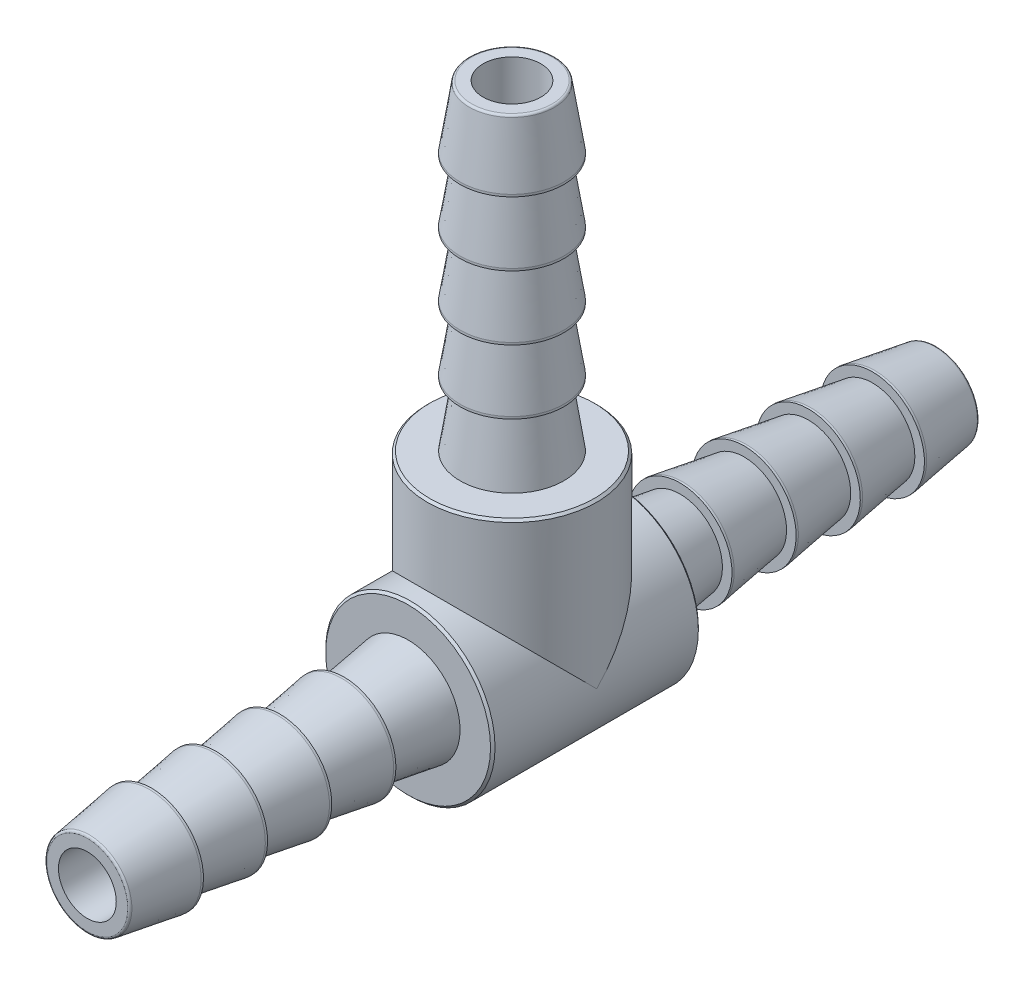
ISO-10303-21;
HEADER;
FILE_DESCRIPTION(('STEP AP214'),'2;1');
FILE_NAME('part.step','',(''),(''),'','','');
FILE_SCHEMA(('AUTOMOTIVE_DESIGN { 1 0 10303 214 1 1 1 1 }'));
ENDSEC;
DATA;
#1=APPLICATION_CONTEXT('core data for automotive mechanical design processes');
#2=APPLICATION_PROTOCOL_DEFINITION('international standard','automotive_design',2000,#1);
#3=PRODUCT_CONTEXT('',#1,'mechanical');
#4=PRODUCT('Part','Part','',(#3));
#5=PRODUCT_RELATED_PRODUCT_CATEGORY('part','',(#4));
#6=PRODUCT_DEFINITION_FORMATION('','',#4);
#7=PRODUCT_DEFINITION_CONTEXT('part definition',#1,'design');
#8=PRODUCT_DEFINITION('design','',#6,#7);
#9=PRODUCT_DEFINITION_SHAPE('','',#8);
#10=(LENGTH_UNIT() NAMED_UNIT(*) SI_UNIT(.MILLI.,.METRE.));
#11=(NAMED_UNIT(*) PLANE_ANGLE_UNIT() SI_UNIT($,.RADIAN.));
#12=(NAMED_UNIT(*) SI_UNIT($,.STERADIAN.) SOLID_ANGLE_UNIT());
#13=UNCERTAINTY_MEASURE_WITH_UNIT(LENGTH_MEASURE(1.E-05),#10,'distance_accuracy_value','');
#14=(GEOMETRIC_REPRESENTATION_CONTEXT(3) GLOBAL_UNCERTAINTY_ASSIGNED_CONTEXT((#13)) GLOBAL_UNIT_ASSIGNED_CONTEXT((#10,
#11,#12)) REPRESENTATION_CONTEXT('',''));
#15=CARTESIAN_POINT('',(0.,0.,0.));
#16=DIRECTION('',(0.,0.,1.));
#17=DIRECTION('',(1.,0.,0.));
#18=AXIS2_PLACEMENT_3D('',#15,#16,#17);
#19=CARTESIAN_POINT('',(0.,0.,23.876));
#20=DIRECTION('',(0.,0.,-1.));
#21=DIRECTION('',(-1.,0.,0.));
#22=AXIS2_PLACEMENT_3D('',#19,#20,#21);
#23=PLANE('',#22);
#24=CARTESIAN_POINT('',(0.,0.,23.876));
#25=DIRECTION('',(0.,0.,-1.));
#26=DIRECTION('',(-1.,0.,0.));
#27=AXIS2_PLACEMENT_3D('',#24,#25,#26);
#28=CIRCLE('',#27,2.27243024163016);
#29=CARTESIAN_POINT('',(-2.27243024163016,0.,23.876));
#30=VERTEX_POINT('',#29);
#31=EDGE_CURVE('E11',#30,#30,#28,.F.);
#32=ORIENTED_EDGE('',*,*,#31,.T.);
#33=EDGE_LOOP('',(#32));
#34=FACE_BOUND('',#33,.T.);
#35=CARTESIAN_POINT('',(0.,0.,23.876));
#36=DIRECTION('',(0.,0.,1.));
#37=DIRECTION('',(1.,0.,0.));
#38=AXIS2_PLACEMENT_3D('',#35,#36,#37);
#39=CIRCLE('',#38,1.6256);
#40=CARTESIAN_POINT('',(1.6256,0.,23.876));
#41=VERTEX_POINT('',#40);
#42=EDGE_CURVE('E91',#41,#41,#39,.T.);
#43=ORIENTED_EDGE('',*,*,#42,.F.);
#44=EDGE_LOOP('',(#43));
#45=FACE_BOUND('',#44,.T.);
#46=ADVANCED_FACE('F43',(#34,#45),#23,.F.);
#47=CARTESIAN_POINT('',(0.,0.,0.));
#48=DIRECTION('',(0.,-1.,0.));
#49=DIRECTION('',(0.,0.,-1.));
#50=AXIS2_PLACEMENT_3D('',#47,#48,#49);
#51=CYLINDRICAL_SURFACE('',#50,4.7625);
#52=CARTESIAN_POINT('',(0.,9.08049999999999,0.));
#53=DIRECTION('',(0.,1.,0.));
#54=DIRECTION('',(0.,0.,1.));
#55=AXIS2_PLACEMENT_3D('',#52,#53,#54);
#56=CIRCLE('',#55,4.7625);
#57=CARTESIAN_POINT('',(0.,9.08049999999999,4.7625));
#58=VERTEX_POINT('',#57);
#59=EDGE_CURVE('E84',#58,#58,#56,.F.);
#60=ORIENTED_EDGE('',*,*,#59,.T.);
#61=EDGE_LOOP('',(#60));
#62=FACE_BOUND('',#61,.T.);
#63=CARTESIAN_POINT('',(0.,0.,0.));
#64=DIRECTION('',(0.,0.707106781186547,0.707106781186547));
#65=DIRECTION('',(0.,-0.707106781186547,0.707106781186547));
#66=AXIS2_PLACEMENT_3D('',#63,#64,#65);
#67=ELLIPSE('',#66,6.73519209080187,4.7625);
#68=CARTESIAN_POINT('',(4.7625,0.,0.));
#69=VERTEX_POINT('',#68);
#70=CARTESIAN_POINT('',(-4.7625,0.,0.));
#71=VERTEX_POINT('',#70);
#72=EDGE_CURVE('E70',#69,#71,#67,.T.);
#73=ORIENTED_EDGE('',*,*,#72,.T.);
#74=CARTESIAN_POINT('',(0.,0.,0.));
#75=DIRECTION('',(0.,-0.707106781186547,0.707106781186547));
#76=DIRECTION('',(0.,0.707106781186547,0.707106781186547));
#77=AXIS2_PLACEMENT_3D('',#74,#75,#76);
#78=ELLIPSE('',#77,6.73519209080187,4.7625);
#79=EDGE_CURVE('E85',#71,#69,#78,.F.);
#80=ORIENTED_EDGE('',*,*,#79,.T.);
#81=EDGE_LOOP('',(#73,#80));
#82=FACE_BOUND('',#81,.T.);
#83=ADVANCED_FACE('F319',(#62,#82),#51,.T.);
#84=CARTESIAN_POINT('',(0.,0.,23.876));
#85=DIRECTION('',(0.,0.,1.));
#86=DIRECTION('',(1.,0.,0.));
#87=AXIS2_PLACEMENT_3D('',#84,#85,#86);
#88=CYLINDRICAL_SURFACE('',#87,4.7625);
#89=CARTESIAN_POINT('',(0.,0.,-5.715));
#90=DIRECTION('',(0.,0.,-1.));
#91=DIRECTION('',(-1.,0.,0.));
#92=AXIS2_PLACEMENT_3D('',#89,#90,#91);
#93=CIRCLE('',#92,4.7625);
#94=CARTESIAN_POINT('',(-4.7625,0.,-5.715));
#95=VERTEX_POINT('',#94);
#96=EDGE_CURVE('E274',#95,#95,#93,.F.);
#97=ORIENTED_EDGE('',*,*,#96,.T.);
#98=EDGE_LOOP('',(#97));
#99=FACE_BOUND('',#98,.T.);
#100=CARTESIAN_POINT('',(0.,0.,5.715));
#101=DIRECTION('',(0.,0.,1.));
#102=DIRECTION('',(1.,0.,0.));
#103=AXIS2_PLACEMENT_3D('',#100,#101,#102);
#104=CIRCLE('',#103,4.7625);
#105=CARTESIAN_POINT('',(4.7625,0.,5.715));
#106=VERTEX_POINT('',#105);
#107=EDGE_CURVE('E270',#106,#106,#104,.F.);
#108=ORIENTED_EDGE('',*,*,#107,.T.);
#109=EDGE_LOOP('',(#108));
#110=FACE_BOUND('',#109,.T.);
#111=ORIENTED_EDGE('',*,*,#79,.F.);
#112=ORIENTED_EDGE('',*,*,#72,.F.);
#113=EDGE_LOOP('',(#111,#112));
#114=FACE_BOUND('',#113,.T.);
#115=ADVANCED_FACE('F325',(#99,#110,#114),#88,.T.);
#116=CARTESIAN_POINT('',(0.,0.,16.7894));
#117=DIRECTION('',(0.,0.,-1.));
#118=DIRECTION('',(0.,1.,0.));
#119=AXIS2_PLACEMENT_3D('',#116,#117,#118);
#120=CONICAL_SURFACE('',#119,2.921,0.153883218638279);
#121=CARTESIAN_POINT('',(0.,0.,20.2692));
#122=DIRECTION('',(0.,0.,-1.));
#123=DIRECTION('',(0.,1.,0.));
#124=AXIS2_PLACEMENT_3D('',#121,#122,#123);
#125=CIRCLE('',#124,2.38125);
#126=CARTESIAN_POINT('',(0.,2.38125,20.2692));
#127=VERTEX_POINT('',#126);
#128=EDGE_CURVE('E231',#127,#127,#125,.T.);
#129=ORIENTED_EDGE('',*,*,#128,.T.);
#130=EDGE_LOOP('',(#129));
#131=FACE_BOUND('',#130,.T.);
#132=CARTESIAN_POINT('',(0.,0.,16.7894));
#133=DIRECTION('',(0.,0.,-1.));
#134=DIRECTION('',(0.,1.,0.));
#135=AXIS2_PLACEMENT_3D('',#132,#133,#134);
#136=CIRCLE('',#135,2.921);
#137=CARTESIAN_POINT('',(0.,2.921,16.7894));
#138=VERTEX_POINT('',#137);
#139=EDGE_CURVE('E239',#138,#138,#136,.T.);
#140=ORIENTED_EDGE('',*,*,#139,.F.);
#141=EDGE_LOOP('',(#140));
#142=FACE_BOUND('',#141,.T.);
#143=ADVANCED_FACE('F479',(#131,#142),#120,.T.);
#144=CARTESIAN_POINT('',(0.,0.,2.2352));
#145=DIRECTION('',(0.,0.,-1.));
#146=DIRECTION('',(0.,1.,0.));
#147=AXIS2_PLACEMENT_3D('',#144,#145,#146);
#148=CYLINDRICAL_SURFACE('',#147,2.921);
#149=ORIENTED_EDGE('',*,*,#139,.T.);
#150=EDGE_LOOP('',(#149));
#151=FACE_BOUND('',#150,.T.);
#152=CARTESIAN_POINT('',(0.,0.,16.6624));
#153=DIRECTION('',(0.,0.,-1.));
#154=DIRECTION('',(0.,1.,0.));
#155=AXIS2_PLACEMENT_3D('',#152,#153,#154);
#156=CIRCLE('',#155,2.921);
#157=CARTESIAN_POINT('',(0.,2.921,16.6624));
#158=VERTEX_POINT('',#157);
#159=EDGE_CURVE('E235',#158,#158,#156,.T.);
#160=ORIENTED_EDGE('',*,*,#159,.F.);
#161=EDGE_LOOP('',(#160));
#162=FACE_BOUND('',#161,.T.);
#163=ADVANCED_FACE('F475',(#151,#162),#148,.T.);
#164=CARTESIAN_POINT('',(0.,2.38125,16.6624));
#165=DIRECTION('',(0.,0.,-1.));
#166=DIRECTION('',(0.,1.,0.));
#167=AXIS2_PLACEMENT_3D('',#164,#165,#166);
#168=PLANE('',#167);
#169=ORIENTED_EDGE('',*,*,#159,.T.);
#170=EDGE_LOOP('',(#169));
#171=FACE_BOUND('',#170,.T.);
#172=CARTESIAN_POINT('',(0.,0.,16.6624));
#173=DIRECTION('',(0.,0.,-1.));
#174=DIRECTION('',(0.,1.,0.));
#175=AXIS2_PLACEMENT_3D('',#172,#173,#174);
#176=CIRCLE('',#175,2.38125);
#177=CARTESIAN_POINT('',(0.,2.38125,16.6624));
#178=VERTEX_POINT('',#177);
#179=EDGE_CURVE('E219',#178,#178,#176,.T.);
#180=ORIENTED_EDGE('',*,*,#179,.F.);
#181=EDGE_LOOP('',(#180));
#182=FACE_BOUND('',#181,.T.);
#183=ADVANCED_FACE('F472',(#171,#182),#168,.T.);
#184=CARTESIAN_POINT('',(0.,0.,20.3962));
#185=DIRECTION('',(0.,0.,-1.));
#186=DIRECTION('',(0.,1.,0.));
#187=AXIS2_PLACEMENT_3D('',#184,#185,#186);
#188=CONICAL_SURFACE('',#187,2.921,0.153883218638279);
#189=CARTESIAN_POINT('',(0.,0.,23.7684661295191));
#190=DIRECTION('',(0.,0.,-1.));
#191=DIRECTION('',(0.,1.,0.));
#192=AXIS2_PLACEMENT_3D('',#189,#190,#191);
#193=CIRCLE('',#192,2.39792952370598);
#194=CARTESIAN_POINT('',(0.,2.39792952370598,23.7684661295191));
#195=VERTEX_POINT('',#194);
#196=EDGE_CURVE('E52',#195,#195,#193,.T.);
#197=ORIENTED_EDGE('',*,*,#196,.T.);
#198=EDGE_LOOP('',(#197));
#199=FACE_BOUND('',#198,.T.);
#200=CARTESIAN_POINT('',(0.,0.,20.3962));
#201=DIRECTION('',(0.,0.,-1.));
#202=DIRECTION('',(0.,1.,0.));
#203=AXIS2_PLACEMENT_3D('',#200,#201,#202);
#204=CIRCLE('',#203,2.921);
#205=CARTESIAN_POINT('',(0.,2.921,20.3962));
#206=VERTEX_POINT('',#205);
#207=EDGE_CURVE('E247',#206,#206,#204,.T.);
#208=ORIENTED_EDGE('',*,*,#207,.F.);
#209=EDGE_LOOP('',(#208));
#210=FACE_BOUND('',#209,.T.);
#211=ADVANCED_FACE('F306',(#199,#210),#188,.T.);
#212=CARTESIAN_POINT('',(0.,0.,5.842));
#213=DIRECTION('',(0.,0.,-1.));
#214=DIRECTION('',(0.,1.,0.));
#215=AXIS2_PLACEMENT_3D('',#212,#213,#214);
#216=CYLINDRICAL_SURFACE('',#215,2.921);
#217=ORIENTED_EDGE('',*,*,#207,.T.);
#218=EDGE_LOOP('',(#217));
#219=FACE_BOUND('',#218,.T.);
#220=CARTESIAN_POINT('',(0.,0.,20.2692));
#221=DIRECTION('',(0.,0.,-1.));
#222=DIRECTION('',(0.,1.,0.));
#223=AXIS2_PLACEMENT_3D('',#220,#221,#222);
#224=CIRCLE('',#223,2.921);
#225=CARTESIAN_POINT('',(0.,2.921,20.2692));
#226=VERTEX_POINT('',#225);
#227=EDGE_CURVE('E243',#226,#226,#224,.T.);
#228=ORIENTED_EDGE('',*,*,#227,.F.);
#229=EDGE_LOOP('',(#228));
#230=FACE_BOUND('',#229,.T.);
#231=ADVANCED_FACE('F486',(#219,#230),#216,.T.);
#232=CARTESIAN_POINT('',(0.,2.38125,20.2692));
#233=DIRECTION('',(0.,0.,-1.));
#234=DIRECTION('',(0.,1.,0.));
#235=AXIS2_PLACEMENT_3D('',#232,#233,#234);
#236=PLANE('',#235);
#237=ORIENTED_EDGE('',*,*,#227,.T.);
#238=EDGE_LOOP('',(#237));
#239=FACE_BOUND('',#238,.T.);
#240=ORIENTED_EDGE('',*,*,#128,.F.);
#241=EDGE_LOOP('',(#240));
#242=FACE_BOUND('',#241,.T.);
#243=ADVANCED_FACE('F470',(#239,#242),#236,.T.);
#244=CARTESIAN_POINT('',(0.,0.,13.1826));
#245=DIRECTION('',(0.,0.,-1.));
#246=DIRECTION('',(0.,1.,0.));
#247=AXIS2_PLACEMENT_3D('',#244,#245,#246);
#248=CONICAL_SURFACE('',#247,2.921,0.153883218638279);
#249=ORIENTED_EDGE('',*,*,#179,.T.);
#250=EDGE_LOOP('',(#249));
#251=FACE_BOUND('',#250,.T.);
#252=CARTESIAN_POINT('',(0.,0.,13.1826));
#253=DIRECTION('',(0.,0.,-1.));
#254=DIRECTION('',(0.,1.,0.));
#255=AXIS2_PLACEMENT_3D('',#252,#253,#254);
#256=CIRCLE('',#255,2.921);
#257=CARTESIAN_POINT('',(0.,2.921,13.1826));
#258=VERTEX_POINT('',#257);
#259=EDGE_CURVE('E227',#258,#258,#256,.T.);
#260=ORIENTED_EDGE('',*,*,#259,.F.);
#261=EDGE_LOOP('',(#260));
#262=FACE_BOUND('',#261,.T.);
#263=ADVANCED_FACE('F466',(#251,#262),#248,.T.);
#264=CARTESIAN_POINT('',(0.,0.,-1.3716));
#265=DIRECTION('',(0.,0.,-1.));
#266=DIRECTION('',(0.,1.,0.));
#267=AXIS2_PLACEMENT_3D('',#264,#265,#266);
#268=CYLINDRICAL_SURFACE('',#267,2.921);
#269=ORIENTED_EDGE('',*,*,#259,.T.);
#270=EDGE_LOOP('',(#269));
#271=FACE_BOUND('',#270,.T.);
#272=CARTESIAN_POINT('',(0.,0.,13.0556));
#273=DIRECTION('',(0.,0.,-1.));
#274=DIRECTION('',(0.,1.,0.));
#275=AXIS2_PLACEMENT_3D('',#272,#273,#274);
#276=CIRCLE('',#275,2.921);
#277=CARTESIAN_POINT('',(0.,2.921,13.0556));
#278=VERTEX_POINT('',#277);
#279=EDGE_CURVE('E223',#278,#278,#276,.T.);
#280=ORIENTED_EDGE('',*,*,#279,.F.);
#281=EDGE_LOOP('',(#280));
#282=FACE_BOUND('',#281,.T.);
#283=ADVANCED_FACE('F462',(#271,#282),#268,.T.);
#284=CARTESIAN_POINT('',(0.,2.38125,13.0556));
#285=DIRECTION('',(0.,0.,-1.));
#286=DIRECTION('',(0.,1.,0.));
#287=AXIS2_PLACEMENT_3D('',#284,#285,#286);
#288=PLANE('',#287);
#289=ORIENTED_EDGE('',*,*,#279,.T.);
#290=EDGE_LOOP('',(#289));
#291=FACE_BOUND('',#290,.T.);
#292=CARTESIAN_POINT('',(0.,0.,13.0556));
#293=DIRECTION('',(0.,0.,-1.));
#294=DIRECTION('',(0.,1.,0.));
#295=AXIS2_PLACEMENT_3D('',#292,#293,#294);
#296=CIRCLE('',#295,2.38125);
#297=CARTESIAN_POINT('',(0.,2.38125,13.0556));
#298=VERTEX_POINT('',#297);
#299=EDGE_CURVE('E207',#298,#298,#296,.T.);
#300=ORIENTED_EDGE('',*,*,#299,.F.);
#301=EDGE_LOOP('',(#300));
#302=FACE_BOUND('',#301,.T.);
#303=ADVANCED_FACE('F458',(#291,#302),#288,.T.);
#304=CARTESIAN_POINT('',(0.,0.,9.5758));
#305=DIRECTION('',(0.,0.,-1.));
#306=DIRECTION('',(0.,1.,0.));
#307=AXIS2_PLACEMENT_3D('',#304,#305,#306);
#308=CONICAL_SURFACE('',#307,2.921,0.153883218638279);
#309=ORIENTED_EDGE('',*,*,#299,.T.);
#310=EDGE_LOOP('',(#309));
#311=FACE_BOUND('',#310,.T.);
#312=CARTESIAN_POINT('',(0.,0.,9.5758));
#313=DIRECTION('',(0.,0.,-1.));
#314=DIRECTION('',(0.,1.,0.));
#315=AXIS2_PLACEMENT_3D('',#312,#313,#314);
#316=CIRCLE('',#315,2.921);
#317=CARTESIAN_POINT('',(0.,2.921,9.5758));
#318=VERTEX_POINT('',#317);
#319=EDGE_CURVE('E215',#318,#318,#316,.T.);
#320=ORIENTED_EDGE('',*,*,#319,.F.);
#321=EDGE_LOOP('',(#320));
#322=FACE_BOUND('',#321,.T.);
#323=ADVANCED_FACE('F454',(#311,#322),#308,.T.);
#324=CARTESIAN_POINT('',(0.,0.,-4.9784));
#325=DIRECTION('',(0.,0.,-1.));
#326=DIRECTION('',(0.,1.,0.));
#327=AXIS2_PLACEMENT_3D('',#324,#325,#326);
#328=CYLINDRICAL_SURFACE('',#327,2.921);
#329=ORIENTED_EDGE('',*,*,#319,.T.);
#330=EDGE_LOOP('',(#329));
#331=FACE_BOUND('',#330,.T.);
#332=CARTESIAN_POINT('',(0.,0.,9.4488));
#333=DIRECTION('',(0.,0.,-1.));
#334=DIRECTION('',(0.,1.,0.));
#335=AXIS2_PLACEMENT_3D('',#332,#333,#334);
#336=CIRCLE('',#335,2.921);
#337=CARTESIAN_POINT('',(0.,2.921,9.4488));
#338=VERTEX_POINT('',#337);
#339=EDGE_CURVE('E211',#338,#338,#336,.T.);
#340=ORIENTED_EDGE('',*,*,#339,.F.);
#341=EDGE_LOOP('',(#340));
#342=FACE_BOUND('',#341,.T.);
#343=ADVANCED_FACE('F450',(#331,#342),#328,.T.);
#344=CARTESIAN_POINT('',(0.,2.38125,9.4488));
#345=DIRECTION('',(0.,0.,-1.));
#346=DIRECTION('',(0.,1.,0.));
#347=AXIS2_PLACEMENT_3D('',#344,#345,#346);
#348=PLANE('',#347);
#349=ORIENTED_EDGE('',*,*,#339,.T.);
#350=EDGE_LOOP('',(#349));
#351=FACE_BOUND('',#350,.T.);
#352=CARTESIAN_POINT('',(0.,0.,9.4488));
#353=DIRECTION('',(0.,0.,1.));
#354=DIRECTION('',(1.,0.,0.));
#355=AXIS2_PLACEMENT_3D('',#352,#353,#354);
#356=CIRCLE('',#355,2.38125);
#357=CARTESIAN_POINT('',(2.38125,0.,9.4488));
#358=VERTEX_POINT('',#357);
#359=EDGE_CURVE('E255',#358,#358,#356,.T.);
#360=ORIENTED_EDGE('',*,*,#359,.T.);
#361=EDGE_LOOP('',(#360));
#362=FACE_BOUND('',#361,.T.);
#363=ADVANCED_FACE('F446',(#351,#362),#348,.T.);
#364=CARTESIAN_POINT('',(0.,2.921,5.842));
#365=DIRECTION('',(0.,0.,1.));
#366=DIRECTION('',(1.,0.,0.));
#367=AXIS2_PLACEMENT_3D('',#364,#365,#366);
#368=PLANE('',#367);
#369=CARTESIAN_POINT('',(0.,0.,5.842));
#370=DIRECTION('',(0.,0.,1.));
#371=DIRECTION('',(1.,0.,0.));
#372=AXIS2_PLACEMENT_3D('',#369,#370,#371);
#373=CIRCLE('',#372,4.6355);
#374=CARTESIAN_POINT('',(4.6355,0.,5.842));
#375=VERTEX_POINT('',#374);
#376=EDGE_CURVE('E282',#375,#375,#373,.T.);
#377=ORIENTED_EDGE('',*,*,#376,.T.);
#378=EDGE_LOOP('',(#377));
#379=FACE_BOUND('',#378,.T.);
#380=CARTESIAN_POINT('',(0.,0.,5.842));
#381=DIRECTION('',(0.,0.,1.));
#382=DIRECTION('',(1.,0.,0.));
#383=AXIS2_PLACEMENT_3D('',#380,#381,#382);
#384=CIRCLE('',#383,2.921);
#385=CARTESIAN_POINT('',(2.921,0.,5.842));
#386=VERTEX_POINT('',#385);
#387=EDGE_CURVE('E251',#386,#386,#384,.T.);
#388=ORIENTED_EDGE('',*,*,#387,.F.);
#389=EDGE_LOOP('',(#388));
#390=FACE_BOUND('',#389,.T.);
#391=ADVANCED_FACE('F449',(#379,#390),#368,.T.);
#392=CARTESIAN_POINT('',(0.,0.,9.4488));
#393=DIRECTION('',(0.,0.,-1.));
#394=DIRECTION('',(-1.,0.,0.));
#395=AXIS2_PLACEMENT_3D('',#392,#393,#394);
#396=CONICAL_SURFACE('',#395,2.38125,0.148545565358798);
#397=ORIENTED_EDGE('',*,*,#387,.T.);
#398=EDGE_LOOP('',(#397));
#399=FACE_BOUND('',#398,.T.);
#400=ORIENTED_EDGE('',*,*,#359,.F.);
#401=EDGE_LOOP('',(#400));
#402=FACE_BOUND('',#401,.T.);
#403=ADVANCED_FACE('F444',(#399,#402),#396,.T.);
#404=CARTESIAN_POINT('',(0.,0.,-9.4488));
#405=DIRECTION('',(0.,0.,1.));
#406=DIRECTION('',(-1.,0.,0.));
#407=AXIS2_PLACEMENT_3D('',#404,#405,#406);
#408=CONICAL_SURFACE('',#407,2.38125,0.148545565358798);
#409=CARTESIAN_POINT('',(0.,0.,-5.842));
#410=DIRECTION('',(0.,0.,1.));
#411=DIRECTION('',(1.,0.,0.));
#412=AXIS2_PLACEMENT_3D('',#409,#410,#411);
#413=CIRCLE('',#412,2.921);
#414=CARTESIAN_POINT('',(2.921,0.,-5.842));
#415=VERTEX_POINT('',#414);
#416=EDGE_CURVE('E203',#415,#415,#413,.T.);
#417=ORIENTED_EDGE('',*,*,#416,.F.);
#418=EDGE_LOOP('',(#417));
#419=FACE_BOUND('',#418,.T.);
#420=CARTESIAN_POINT('',(0.,0.,-9.4488));
#421=DIRECTION('',(0.,0.,-1.));
#422=DIRECTION('',(0.,1.,0.));
#423=AXIS2_PLACEMENT_3D('',#420,#421,#422);
#424=CIRCLE('',#423,2.38125);
#425=CARTESIAN_POINT('',(0.,2.38125,-9.4488));
#426=VERTEX_POINT('',#425);
#427=EDGE_CURVE('E159',#426,#426,#424,.T.);
#428=ORIENTED_EDGE('',*,*,#427,.F.);
#429=EDGE_LOOP('',(#428));
#430=FACE_BOUND('',#429,.T.);
#431=ADVANCED_FACE('F440',(#419,#430),#408,.T.);
#432=CARTESIAN_POINT('',(0.,2.921,-5.842));
#433=DIRECTION('',(0.,0.,-1.));
#434=DIRECTION('',(1.,0.,0.));
#435=AXIS2_PLACEMENT_3D('',#432,#433,#434);
#436=PLANE('',#435);
#437=CARTESIAN_POINT('',(0.,0.,-5.842));
#438=DIRECTION('',(0.,0.,-1.));
#439=DIRECTION('',(-1.,0.,0.));
#440=AXIS2_PLACEMENT_3D('',#437,#438,#439);
#441=CIRCLE('',#440,4.63550000000001);
#442=CARTESIAN_POINT('',(-4.63550000000001,0.,-5.842));
#443=VERTEX_POINT('',#442);
#444=EDGE_CURVE('E278',#443,#443,#441,.T.);
#445=ORIENTED_EDGE('',*,*,#444,.T.);
#446=EDGE_LOOP('',(#445));
#447=FACE_BOUND('',#446,.T.);
#448=ORIENTED_EDGE('',*,*,#416,.T.);
#449=EDGE_LOOP('',(#448));
#450=FACE_BOUND('',#449,.T.);
#451=ADVANCED_FACE('F402',(#447,#450),#436,.T.);
#452=CARTESIAN_POINT('',(0.,0.,-9.5758));
#453=DIRECTION('',(0.,0.,1.));
#454=DIRECTION('',(0.,1.,0.));
#455=AXIS2_PLACEMENT_3D('',#452,#453,#454);
#456=CONICAL_SURFACE('',#455,2.921,0.153883218638279);
#457=CARTESIAN_POINT('',(0.,0.,-13.0556));
#458=DIRECTION('',(0.,0.,-1.));
#459=DIRECTION('',(0.,1.,0.));
#460=AXIS2_PLACEMENT_3D('',#457,#458,#459);
#461=CIRCLE('',#460,2.38125);
#462=CARTESIAN_POINT('',(0.,2.38125,-13.0556));
#463=VERTEX_POINT('',#462);
#464=EDGE_CURVE('E155',#463,#463,#461,.T.);
#465=ORIENTED_EDGE('',*,*,#464,.F.);
#466=EDGE_LOOP('',(#465));
#467=FACE_BOUND('',#466,.T.);
#468=CARTESIAN_POINT('',(0.,0.,-9.5758));
#469=DIRECTION('',(0.,0.,-1.));
#470=DIRECTION('',(0.,1.,0.));
#471=AXIS2_PLACEMENT_3D('',#468,#469,#470);
#472=CIRCLE('',#471,2.921);
#473=CARTESIAN_POINT('',(0.,2.921,-9.5758));
#474=VERTEX_POINT('',#473);
#475=EDGE_CURVE('E167',#474,#474,#472,.T.);
#476=ORIENTED_EDGE('',*,*,#475,.T.);
#477=EDGE_LOOP('',(#476));
#478=FACE_BOUND('',#477,.T.);
#479=ADVANCED_FACE('F398',(#467,#478),#456,.T.);
#480=CARTESIAN_POINT('',(0.,0.,4.9784));
#481=DIRECTION('',(0.,0.,1.));
#482=DIRECTION('',(0.,1.,0.));
#483=AXIS2_PLACEMENT_3D('',#480,#481,#482);
#484=CYLINDRICAL_SURFACE('',#483,2.921);
#485=ORIENTED_EDGE('',*,*,#475,.F.);
#486=EDGE_LOOP('',(#485));
#487=FACE_BOUND('',#486,.T.);
#488=CARTESIAN_POINT('',(0.,0.,-9.4488));
#489=DIRECTION('',(0.,0.,-1.));
#490=DIRECTION('',(0.,1.,0.));
#491=AXIS2_PLACEMENT_3D('',#488,#489,#490);
#492=CIRCLE('',#491,2.921);
#493=CARTESIAN_POINT('',(0.,2.921,-9.4488));
#494=VERTEX_POINT('',#493);
#495=EDGE_CURVE('E163',#494,#494,#492,.T.);
#496=ORIENTED_EDGE('',*,*,#495,.T.);
#497=EDGE_LOOP('',(#496));
#498=FACE_BOUND('',#497,.T.);
#499=ADVANCED_FACE('F394',(#487,#498),#484,.T.);
#500=CARTESIAN_POINT('',(0.,2.38125,-9.4488));
#501=DIRECTION('',(0.,0.,1.));
#502=DIRECTION('',(0.,1.,0.));
#503=AXIS2_PLACEMENT_3D('',#500,#501,#502);
#504=PLANE('',#503);
#505=ORIENTED_EDGE('',*,*,#495,.F.);
#506=EDGE_LOOP('',(#505));
#507=FACE_BOUND('',#506,.T.);
#508=ORIENTED_EDGE('',*,*,#427,.T.);
#509=EDGE_LOOP('',(#508));
#510=FACE_BOUND('',#509,.T.);
#511=ADVANCED_FACE('F336',(#507,#510),#504,.T.);
#512=CARTESIAN_POINT('',(0.,0.,-23.876));
#513=DIRECTION('',(0.,0.,1.));
#514=DIRECTION('',(1.,0.,0.));
#515=AXIS2_PLACEMENT_3D('',#512,#513,#514);
#516=PLANE('',#515);
#517=CARTESIAN_POINT('',(0.,0.,-23.876));
#518=DIRECTION('',(0.,0.,1.));
#519=DIRECTION('',(1.,0.,0.));
#520=AXIS2_PLACEMENT_3D('',#517,#518,#519);
#521=CIRCLE('',#520,2.27243024163016);
#522=CARTESIAN_POINT('',(2.27243024163016,0.,-23.876));
#523=VERTEX_POINT('',#522);
#524=EDGE_CURVE('E298',#523,#523,#521,.F.);
#525=ORIENTED_EDGE('',*,*,#524,.T.);
#526=EDGE_LOOP('',(#525));
#527=FACE_BOUND('',#526,.T.);
#528=ADVANCED_FACE('F332',(#527),#516,.F.);
#529=CARTESIAN_POINT('',(0.,0.,-20.3962));
#530=DIRECTION('',(0.,0.,1.));
#531=DIRECTION('',(0.,1.,0.));
#532=AXIS2_PLACEMENT_3D('',#529,#530,#531);
#533=CONICAL_SURFACE('',#532,2.921,0.153883218638279);
#534=CARTESIAN_POINT('',(0.,0.,-23.7684661295191));
#535=DIRECTION('',(0.,0.,1.));
#536=DIRECTION('',(0.,-1.,0.));
#537=AXIS2_PLACEMENT_3D('',#534,#535,#536);
#538=CIRCLE('',#537,2.39792952370598);
#539=CARTESIAN_POINT('',(0.,-2.39792952370598,-23.7684661295191));
#540=VERTEX_POINT('',#539);
#541=EDGE_CURVE('E294',#540,#540,#538,.T.);
#542=ORIENTED_EDGE('',*,*,#541,.T.);
#543=EDGE_LOOP('',(#542));
#544=FACE_BOUND('',#543,.T.);
#545=CARTESIAN_POINT('',(0.,0.,-20.3962));
#546=DIRECTION('',(0.,0.,-1.));
#547=DIRECTION('',(0.,1.,0.));
#548=AXIS2_PLACEMENT_3D('',#545,#546,#547);
#549=CIRCLE('',#548,2.921);
#550=CARTESIAN_POINT('',(0.,2.921,-20.3962));
#551=VERTEX_POINT('',#550);
#552=EDGE_CURVE('E199',#551,#551,#549,.T.);
#553=ORIENTED_EDGE('',*,*,#552,.T.);
#554=EDGE_LOOP('',(#553));
#555=FACE_BOUND('',#554,.T.);
#556=ADVANCED_FACE('F335',(#544,#555),#533,.T.);
#557=CARTESIAN_POINT('',(0.,0.,-5.842));
#558=DIRECTION('',(0.,0.,1.));
#559=DIRECTION('',(0.,1.,0.));
#560=AXIS2_PLACEMENT_3D('',#557,#558,#559);
#561=CYLINDRICAL_SURFACE('',#560,2.921);
#562=ORIENTED_EDGE('',*,*,#552,.F.);
#563=EDGE_LOOP('',(#562));
#564=FACE_BOUND('',#563,.T.);
#565=CARTESIAN_POINT('',(0.,0.,-20.2692));
#566=DIRECTION('',(0.,0.,-1.));
#567=DIRECTION('',(0.,1.,0.));
#568=AXIS2_PLACEMENT_3D('',#565,#566,#567);
#569=CIRCLE('',#568,2.921);
#570=CARTESIAN_POINT('',(0.,2.921,-20.2692));
#571=VERTEX_POINT('',#570);
#572=EDGE_CURVE('E195',#571,#571,#569,.T.);
#573=ORIENTED_EDGE('',*,*,#572,.T.);
#574=EDGE_LOOP('',(#573));
#575=FACE_BOUND('',#574,.T.);
#576=ADVANCED_FACE('F430',(#564,#575),#561,.T.);
#577=CARTESIAN_POINT('',(0.,2.38125,-20.2692));
#578=DIRECTION('',(0.,0.,1.));
#579=DIRECTION('',(0.,1.,0.));
#580=AXIS2_PLACEMENT_3D('',#577,#578,#579);
#581=PLANE('',#580);
#582=ORIENTED_EDGE('',*,*,#572,.F.);
#583=EDGE_LOOP('',(#582));
#584=FACE_BOUND('',#583,.T.);
#585=CARTESIAN_POINT('',(0.,0.,-20.2692));
#586=DIRECTION('',(0.,0.,-1.));
#587=DIRECTION('',(0.,1.,0.));
#588=AXIS2_PLACEMENT_3D('',#585,#586,#587);
#589=CIRCLE('',#588,2.38125);
#590=CARTESIAN_POINT('',(0.,2.38125,-20.2692));
#591=VERTEX_POINT('',#590);
#592=EDGE_CURVE('E183',#591,#591,#589,.T.);
#593=ORIENTED_EDGE('',*,*,#592,.T.);
#594=EDGE_LOOP('',(#593));
#595=FACE_BOUND('',#594,.T.);
#596=ADVANCED_FACE('F426',(#584,#595),#581,.T.);
#597=CARTESIAN_POINT('',(0.,0.,-16.7894));
#598=DIRECTION('',(0.,0.,1.));
#599=DIRECTION('',(0.,1.,0.));
#600=AXIS2_PLACEMENT_3D('',#597,#598,#599);
#601=CONICAL_SURFACE('',#600,2.921,0.153883218638279);
#602=ORIENTED_EDGE('',*,*,#592,.F.);
#603=EDGE_LOOP('',(#602));
#604=FACE_BOUND('',#603,.T.);
#605=CARTESIAN_POINT('',(0.,0.,-16.7894));
#606=DIRECTION('',(0.,0.,-1.));
#607=DIRECTION('',(0.,1.,0.));
#608=AXIS2_PLACEMENT_3D('',#605,#606,#607);
#609=CIRCLE('',#608,2.921);
#610=CARTESIAN_POINT('',(0.,2.921,-16.7894));
#611=VERTEX_POINT('',#610);
#612=EDGE_CURVE('E191',#611,#611,#609,.T.);
#613=ORIENTED_EDGE('',*,*,#612,.T.);
#614=EDGE_LOOP('',(#613));
#615=FACE_BOUND('',#614,.T.);
#616=ADVANCED_FACE('F422',(#604,#615),#601,.T.);
#617=CARTESIAN_POINT('',(0.,0.,-2.2352));
#618=DIRECTION('',(0.,0.,1.));
#619=DIRECTION('',(0.,1.,0.));
#620=AXIS2_PLACEMENT_3D('',#617,#618,#619);
#621=CYLINDRICAL_SURFACE('',#620,2.921);
#622=ORIENTED_EDGE('',*,*,#612,.F.);
#623=EDGE_LOOP('',(#622));
#624=FACE_BOUND('',#623,.T.);
#625=CARTESIAN_POINT('',(0.,0.,-16.6624));
#626=DIRECTION('',(0.,0.,-1.));
#627=DIRECTION('',(0.,1.,0.));
#628=AXIS2_PLACEMENT_3D('',#625,#626,#627);
#629=CIRCLE('',#628,2.921);
#630=CARTESIAN_POINT('',(0.,2.921,-16.6624));
#631=VERTEX_POINT('',#630);
#632=EDGE_CURVE('E187',#631,#631,#629,.T.);
#633=ORIENTED_EDGE('',*,*,#632,.T.);
#634=EDGE_LOOP('',(#633));
#635=FACE_BOUND('',#634,.T.);
#636=ADVANCED_FACE('F418',(#624,#635),#621,.T.);
#637=CARTESIAN_POINT('',(0.,2.38125,-16.6624));
#638=DIRECTION('',(0.,0.,1.));
#639=DIRECTION('',(0.,1.,0.));
#640=AXIS2_PLACEMENT_3D('',#637,#638,#639);
#641=PLANE('',#640);
#642=ORIENTED_EDGE('',*,*,#632,.F.);
#643=EDGE_LOOP('',(#642));
#644=FACE_BOUND('',#643,.T.);
#645=CARTESIAN_POINT('',(0.,0.,-16.6624));
#646=DIRECTION('',(0.,0.,-1.));
#647=DIRECTION('',(0.,1.,0.));
#648=AXIS2_PLACEMENT_3D('',#645,#646,#647);
#649=CIRCLE('',#648,2.38125);
#650=CARTESIAN_POINT('',(0.,2.38125,-16.6624));
#651=VERTEX_POINT('',#650);
#652=EDGE_CURVE('E171',#651,#651,#649,.T.);
#653=ORIENTED_EDGE('',*,*,#652,.T.);
#654=EDGE_LOOP('',(#653));
#655=FACE_BOUND('',#654,.T.);
#656=ADVANCED_FACE('F414',(#644,#655),#641,.T.);
#657=CARTESIAN_POINT('',(0.,0.,-13.1826));
#658=DIRECTION('',(0.,0.,1.));
#659=DIRECTION('',(0.,1.,0.));
#660=AXIS2_PLACEMENT_3D('',#657,#658,#659);
#661=CONICAL_SURFACE('',#660,2.921,0.153883218638279);
#662=ORIENTED_EDGE('',*,*,#652,.F.);
#663=EDGE_LOOP('',(#662));
#664=FACE_BOUND('',#663,.T.);
#665=CARTESIAN_POINT('',(0.,0.,-13.1826));
#666=DIRECTION('',(0.,0.,-1.));
#667=DIRECTION('',(0.,1.,0.));
#668=AXIS2_PLACEMENT_3D('',#665,#666,#667);
#669=CIRCLE('',#668,2.921);
#670=CARTESIAN_POINT('',(0.,2.921,-13.1826));
#671=VERTEX_POINT('',#670);
#672=EDGE_CURVE('E179',#671,#671,#669,.T.);
#673=ORIENTED_EDGE('',*,*,#672,.T.);
#674=EDGE_LOOP('',(#673));
#675=FACE_BOUND('',#674,.T.);
#676=ADVANCED_FACE('F410',(#664,#675),#661,.T.);
#677=CARTESIAN_POINT('',(0.,0.,1.3716));
#678=DIRECTION('',(0.,0.,1.));
#679=DIRECTION('',(0.,1.,0.));
#680=AXIS2_PLACEMENT_3D('',#677,#678,#679);
#681=CYLINDRICAL_SURFACE('',#680,2.921);
#682=ORIENTED_EDGE('',*,*,#672,.F.);
#683=EDGE_LOOP('',(#682));
#684=FACE_BOUND('',#683,.T.);
#685=CARTESIAN_POINT('',(0.,0.,-13.0556));
#686=DIRECTION('',(0.,0.,-1.));
#687=DIRECTION('',(0.,1.,0.));
#688=AXIS2_PLACEMENT_3D('',#685,#686,#687);
#689=CIRCLE('',#688,2.921);
#690=CARTESIAN_POINT('',(0.,2.921,-13.0556));
#691=VERTEX_POINT('',#690);
#692=EDGE_CURVE('E175',#691,#691,#689,.T.);
#693=ORIENTED_EDGE('',*,*,#692,.T.);
#694=EDGE_LOOP('',(#693));
#695=FACE_BOUND('',#694,.T.);
#696=ADVANCED_FACE('F406',(#684,#695),#681,.T.);
#697=CARTESIAN_POINT('',(0.,2.38125,-13.0556));
#698=DIRECTION('',(0.,0.,1.));
#699=DIRECTION('',(0.,1.,0.));
#700=AXIS2_PLACEMENT_3D('',#697,#698,#699);
#701=PLANE('',#700);
#702=ORIENTED_EDGE('',*,*,#692,.F.);
#703=EDGE_LOOP('',(#702));
#704=FACE_BOUND('',#703,.T.);
#705=ORIENTED_EDGE('',*,*,#464,.T.);
#706=EDGE_LOOP('',(#705));
#707=FACE_BOUND('',#706,.T.);
#708=ADVANCED_FACE('F385',(#704,#707),#701,.T.);
#709=CARTESIAN_POINT('',(0.,9.2075,0.));
#710=DIRECTION('',(0.,-1.,0.));
#711=DIRECTION('',(0.,0.,-1.));
#712=AXIS2_PLACEMENT_3D('',#709,#710,#711);
#713=CONICAL_SURFACE('',#712,2.921,0.148545565358799);
#714=CARTESIAN_POINT('',(0.,12.8143,0.));
#715=DIRECTION('',(0.,1.,0.));
#716=DIRECTION('',(0.,0.,1.));
#717=AXIS2_PLACEMENT_3D('',#714,#715,#716);
#718=CIRCLE('',#717,2.38125);
#719=CARTESIAN_POINT('',(0.,12.8143,2.38125));
#720=VERTEX_POINT('',#719);
#721=EDGE_CURVE('E115',#720,#720,#718,.T.);
#722=ORIENTED_EDGE('',*,*,#721,.F.);
#723=EDGE_LOOP('',(#722));
#724=FACE_BOUND('',#723,.T.);
#725=CARTESIAN_POINT('',(0.,9.2075,0.));
#726=DIRECTION('',(0.,-1.,0.));
#727=DIRECTION('',(0.,0.,-1.));
#728=AXIS2_PLACEMENT_3D('',#725,#726,#727);
#729=CIRCLE('',#728,2.921);
#730=CARTESIAN_POINT('',(0.,9.2075,-2.921));
#731=VERTEX_POINT('',#730);
#732=EDGE_CURVE('E151',#731,#731,#729,.T.);
#733=ORIENTED_EDGE('',*,*,#732,.F.);
#734=EDGE_LOOP('',(#733));
#735=FACE_BOUND('',#734,.T.);
#736=ADVANCED_FACE('F382',(#724,#735),#713,.T.);
#737=CARTESIAN_POINT('',(0.,9.2075,2.921));
#738=DIRECTION('',(0.,1.,0.));
#739=DIRECTION('',(0.,0.,1.));
#740=AXIS2_PLACEMENT_3D('',#737,#738,#739);
#741=PLANE('',#740);
#742=CARTESIAN_POINT('',(0.,9.2075,0.));
#743=DIRECTION('',(0.,1.,0.));
#744=DIRECTION('',(0.,0.,1.));
#745=AXIS2_PLACEMENT_3D('',#742,#743,#744);
#746=CIRCLE('',#745,4.63549999999999);
#747=CARTESIAN_POINT('',(0.,9.2075,4.63549999999999));
#748=VERTEX_POINT('',#747);
#749=EDGE_CURVE('E266',#748,#748,#746,.T.);
#750=ORIENTED_EDGE('',*,*,#749,.T.);
#751=EDGE_LOOP('',(#750));
#752=FACE_BOUND('',#751,.T.);
#753=ORIENTED_EDGE('',*,*,#732,.T.);
#754=EDGE_LOOP('',(#753));
#755=FACE_BOUND('',#754,.T.);
#756=ADVANCED_FACE('F378',(#752,#755),#741,.T.);
#757=CARTESIAN_POINT('',(0.,12.8143,2.921));
#758=DIRECTION('',(0.,-1.,0.));
#759=DIRECTION('',(0.,0.,-1.));
#760=AXIS2_PLACEMENT_3D('',#757,#758,#759);
#761=PLANE('',#760);
#762=ORIENTED_EDGE('',*,*,#721,.T.);
#763=EDGE_LOOP('',(#762));
#764=FACE_BOUND('',#763,.T.);
#765=CARTESIAN_POINT('',(0.,12.8143,0.));
#766=DIRECTION('',(0.,1.,0.));
#767=DIRECTION('',(0.,0.,1.));
#768=AXIS2_PLACEMENT_3D('',#765,#766,#767);
#769=CIRCLE('',#768,2.921);
#770=CARTESIAN_POINT('',(0.,12.8143,2.921));
#771=VERTEX_POINT('',#770);
#772=EDGE_CURVE('E111',#771,#771,#769,.T.);
#773=ORIENTED_EDGE('',*,*,#772,.F.);
#774=EDGE_LOOP('',(#773));
#775=FACE_BOUND('',#774,.T.);
#776=ADVANCED_FACE('F381',(#764,#775),#761,.T.);
#777=CARTESIAN_POINT('',(0.,16.4211,0.));
#778=DIRECTION('',(0.,1.,0.));
#779=DIRECTION('',(0.,0.,1.));
#780=AXIS2_PLACEMENT_3D('',#777,#778,#779);
#781=CYLINDRICAL_SURFACE('',#780,2.921);
#782=ORIENTED_EDGE('',*,*,#772,.T.);
#783=EDGE_LOOP('',(#782));
#784=FACE_BOUND('',#783,.T.);
#785=CARTESIAN_POINT('',(0.,12.9413,0.));
#786=DIRECTION('',(0.,1.,0.));
#787=DIRECTION('',(0.,0.,1.));
#788=AXIS2_PLACEMENT_3D('',#785,#786,#787);
#789=CIRCLE('',#788,2.921);
#790=CARTESIAN_POINT('',(0.,12.9413,2.921));
#791=VERTEX_POINT('',#790);
#792=EDGE_CURVE('E103',#791,#791,#789,.T.);
#793=ORIENTED_EDGE('',*,*,#792,.F.);
#794=EDGE_LOOP('',(#793));
#795=FACE_BOUND('',#794,.T.);
#796=ADVANCED_FACE('F586',(#784,#795),#781,.T.);
#797=CARTESIAN_POINT('',(0.,16.4211,0.));
#798=DIRECTION('',(0.,-1.,0.));
#799=DIRECTION('',(0.,0.,-1.));
#800=AXIS2_PLACEMENT_3D('',#797,#798,#799);
#801=CONICAL_SURFACE('',#800,2.38125,0.153883218638279);
#802=ORIENTED_EDGE('',*,*,#792,.T.);
#803=EDGE_LOOP('',(#802));
#804=FACE_BOUND('',#803,.T.);
#805=CARTESIAN_POINT('',(0.,16.4211,0.));
#806=DIRECTION('',(0.,1.,0.));
#807=DIRECTION('',(0.,0.,1.));
#808=AXIS2_PLACEMENT_3D('',#805,#806,#807);
#809=CIRCLE('',#808,2.38125);
#810=CARTESIAN_POINT('',(0.,16.4211,2.38125));
#811=VERTEX_POINT('',#810);
#812=EDGE_CURVE('E97',#811,#811,#809,.T.);
#813=ORIENTED_EDGE('',*,*,#812,.F.);
#814=EDGE_LOOP('',(#813));
#815=FACE_BOUND('',#814,.T.);
#816=ADVANCED_FACE('F390',(#804,#815),#801,.T.);
#817=CARTESIAN_POINT('',(0.,27.2415,0.));
#818=DIRECTION('',(0.,-1.,0.));
#819=DIRECTION('',(0.,0.,-1.));
#820=AXIS2_PLACEMENT_3D('',#817,#818,#819);
#821=PLANE('',#820);
#822=CARTESIAN_POINT('',(0.,27.2415,0.));
#823=DIRECTION('',(0.,-1.,0.));
#824=DIRECTION('',(0.,0.,-1.));
#825=AXIS2_PLACEMENT_3D('',#822,#823,#824);
#826=CIRCLE('',#825,2.27243024163016);
#827=CARTESIAN_POINT('',(0.,27.2415,-2.27243024163016));
#828=VERTEX_POINT('',#827);
#829=EDGE_CURVE('E290',#828,#828,#826,.F.);
#830=ORIENTED_EDGE('',*,*,#829,.T.);
#831=EDGE_LOOP('',(#830));
#832=FACE_BOUND('',#831,.T.);
#833=CARTESIAN_POINT('',(0.,27.2415,0.));
#834=DIRECTION('',(0.,1.,0.));
#835=DIRECTION('',(0.,0.,1.));
#836=AXIS2_PLACEMENT_3D('',#833,#834,#835);
#837=CIRCLE('',#836,1.6256);
#838=CARTESIAN_POINT('',(0.,27.2415,1.6256));
#839=VERTEX_POINT('',#838);
#840=EDGE_CURVE('E92',#839,#839,#837,.T.);
#841=ORIENTED_EDGE('',*,*,#840,.F.);
#842=EDGE_LOOP('',(#841));
#843=FACE_BOUND('',#842,.T.);
#844=ADVANCED_FACE('F362',(#832,#843),#821,.F.);
#845=CARTESIAN_POINT('',(0.,27.2415,0.));
#846=DIRECTION('',(0.,-1.,0.));
#847=DIRECTION('',(0.,0.,-1.));
#848=AXIS2_PLACEMENT_3D('',#845,#846,#847);
#849=CONICAL_SURFACE('',#848,2.38125,0.153883218638279);
#850=CARTESIAN_POINT('',(0.,27.1339661295191,0.));
#851=DIRECTION('',(0.,-1.,0.));
#852=DIRECTION('',(0.,0.,-1.));
#853=AXIS2_PLACEMENT_3D('',#850,#851,#852);
#854=CIRCLE('',#853,2.39792952370598);
#855=CARTESIAN_POINT('',(0.,27.1339661295191,-2.39792952370598));
#856=VERTEX_POINT('',#855);
#857=EDGE_CURVE('E286',#856,#856,#854,.T.);
#858=ORIENTED_EDGE('',*,*,#857,.T.);
#859=EDGE_LOOP('',(#858));
#860=FACE_BOUND('',#859,.T.);
#861=CARTESIAN_POINT('',(0.,23.7617,0.));
#862=DIRECTION('',(0.,1.,0.));
#863=DIRECTION('',(0.,0.,1.));
#864=AXIS2_PLACEMENT_3D('',#861,#862,#863);
#865=CIRCLE('',#864,2.921);
#866=CARTESIAN_POINT('',(0.,23.7617,2.921));
#867=VERTEX_POINT('',#866);
#868=EDGE_CURVE('E143',#867,#867,#865,.T.);
#869=ORIENTED_EDGE('',*,*,#868,.T.);
#870=EDGE_LOOP('',(#869));
#871=FACE_BOUND('',#870,.T.);
#872=ADVANCED_FACE('F358',(#860,#871),#849,.T.);
#873=CARTESIAN_POINT('',(0.,27.2415,0.));
#874=DIRECTION('',(0.,1.,0.));
#875=DIRECTION('',(0.,0.,1.));
#876=AXIS2_PLACEMENT_3D('',#873,#874,#875);
#877=CYLINDRICAL_SURFACE('',#876,2.921);
#878=CARTESIAN_POINT('',(0.,23.6347,0.));
#879=DIRECTION('',(0.,1.,0.));
#880=DIRECTION('',(0.,0.,1.));
#881=AXIS2_PLACEMENT_3D('',#878,#879,#880);
#882=CIRCLE('',#881,2.921);
#883=CARTESIAN_POINT('',(0.,23.6347,2.921));
#884=VERTEX_POINT('',#883);
#885=EDGE_CURVE('E147',#884,#884,#882,.T.);
#886=ORIENTED_EDGE('',*,*,#885,.T.);
#887=EDGE_LOOP('',(#886));
#888=FACE_BOUND('',#887,.T.);
#889=ORIENTED_EDGE('',*,*,#868,.F.);
#890=EDGE_LOOP('',(#889));
#891=FACE_BOUND('',#890,.T.);
#892=ADVANCED_FACE('F361',(#888,#891),#877,.T.);
#893=CARTESIAN_POINT('',(0.,23.6347,2.921));
#894=DIRECTION('',(0.,-1.,0.));
#895=DIRECTION('',(0.,0.,-1.));
#896=AXIS2_PLACEMENT_3D('',#893,#894,#895);
#897=PLANE('',#896);
#898=CARTESIAN_POINT('',(0.,23.6347,0.));
#899=DIRECTION('',(0.,1.,0.));
#900=DIRECTION('',(0.,0.,1.));
#901=AXIS2_PLACEMENT_3D('',#898,#899,#900);
#902=CIRCLE('',#901,2.38125);
#903=CARTESIAN_POINT('',(0.,23.6347,2.38125));
#904=VERTEX_POINT('',#903);
#905=EDGE_CURVE('E131',#904,#904,#902,.T.);
#906=ORIENTED_EDGE('',*,*,#905,.T.);
#907=EDGE_LOOP('',(#906));
#908=FACE_BOUND('',#907,.T.);
#909=ORIENTED_EDGE('',*,*,#885,.F.);
#910=EDGE_LOOP('',(#909));
#911=FACE_BOUND('',#910,.T.);
#912=ADVANCED_FACE('F367',(#908,#911),#897,.T.);
#913=CARTESIAN_POINT('',(0.,23.6347,0.));
#914=DIRECTION('',(0.,-1.,0.));
#915=DIRECTION('',(0.,0.,-1.));
#916=AXIS2_PLACEMENT_3D('',#913,#914,#915);
#917=CONICAL_SURFACE('',#916,2.38125,0.153883218638279);
#918=CARTESIAN_POINT('',(0.,20.1549,0.));
#919=DIRECTION('',(0.,1.,0.));
#920=DIRECTION('',(0.,0.,1.));
#921=AXIS2_PLACEMENT_3D('',#918,#919,#920);
#922=CIRCLE('',#921,2.921);
#923=CARTESIAN_POINT('',(0.,20.1549,2.921));
#924=VERTEX_POINT('',#923);
#925=EDGE_CURVE('E135',#924,#924,#922,.T.);
#926=ORIENTED_EDGE('',*,*,#925,.T.);
#927=EDGE_LOOP('',(#926));
#928=FACE_BOUND('',#927,.T.);
#929=ORIENTED_EDGE('',*,*,#905,.F.);
#930=EDGE_LOOP('',(#929));
#931=FACE_BOUND('',#930,.T.);
#932=ADVANCED_FACE('F373',(#928,#931),#917,.T.);
#933=CARTESIAN_POINT('',(0.,23.6347,0.));
#934=DIRECTION('',(0.,1.,0.));
#935=DIRECTION('',(0.,0.,1.));
#936=AXIS2_PLACEMENT_3D('',#933,#934,#935);
#937=CYLINDRICAL_SURFACE('',#936,2.921);
#938=CARTESIAN_POINT('',(0.,20.0279,0.));
#939=DIRECTION('',(0.,1.,0.));
#940=DIRECTION('',(0.,0.,1.));
#941=AXIS2_PLACEMENT_3D('',#938,#939,#940);
#942=CIRCLE('',#941,2.921);
#943=CARTESIAN_POINT('',(0.,20.0279,2.921));
#944=VERTEX_POINT('',#943);
#945=EDGE_CURVE('E139',#944,#944,#942,.T.);
#946=ORIENTED_EDGE('',*,*,#945,.T.);
#947=EDGE_LOOP('',(#946));
#948=FACE_BOUND('',#947,.T.);
#949=ORIENTED_EDGE('',*,*,#925,.F.);
#950=EDGE_LOOP('',(#949));
#951=FACE_BOUND('',#950,.T.);
#952=ADVANCED_FACE('F703',(#948,#951),#937,.T.);
#953=CARTESIAN_POINT('',(0.,20.0279,2.921));
#954=DIRECTION('',(0.,-1.,0.));
#955=DIRECTION('',(0.,0.,-1.));
#956=AXIS2_PLACEMENT_3D('',#953,#954,#955);
#957=PLANE('',#956);
#958=CARTESIAN_POINT('',(0.,20.0279,0.));
#959=DIRECTION('',(0.,1.,0.));
#960=DIRECTION('',(0.,0.,1.));
#961=AXIS2_PLACEMENT_3D('',#958,#959,#960);
#962=CIRCLE('',#961,2.38125);
#963=CARTESIAN_POINT('',(0.,20.0279,2.38125));
#964=VERTEX_POINT('',#963);
#965=EDGE_CURVE('E119',#964,#964,#962,.T.);
#966=ORIENTED_EDGE('',*,*,#965,.T.);
#967=EDGE_LOOP('',(#966));
#968=FACE_BOUND('',#967,.T.);
#969=ORIENTED_EDGE('',*,*,#945,.F.);
#970=EDGE_LOOP('',(#969));
#971=FACE_BOUND('',#970,.T.);
#972=ADVANCED_FACE('F694',(#968,#971),#957,.T.);
#973=CARTESIAN_POINT('',(0.,20.0279,0.));
#974=DIRECTION('',(0.,-1.,0.));
#975=DIRECTION('',(0.,0.,-1.));
#976=AXIS2_PLACEMENT_3D('',#973,#974,#975);
#977=CONICAL_SURFACE('',#976,2.38125,0.153883218638279);
#978=CARTESIAN_POINT('',(0.,16.5481,0.));
#979=DIRECTION('',(0.,1.,0.));
#980=DIRECTION('',(0.,0.,1.));
#981=AXIS2_PLACEMENT_3D('',#978,#979,#980);
#982=CIRCLE('',#981,2.921);
#983=CARTESIAN_POINT('',(0.,16.5481,2.921));
#984=VERTEX_POINT('',#983);
#985=EDGE_CURVE('E123',#984,#984,#982,.T.);
#986=ORIENTED_EDGE('',*,*,#985,.T.);
#987=EDGE_LOOP('',(#986));
#988=FACE_BOUND('',#987,.T.);
#989=ORIENTED_EDGE('',*,*,#965,.F.);
#990=EDGE_LOOP('',(#989));
#991=FACE_BOUND('',#990,.T.);
#992=ADVANCED_FACE('F685',(#988,#991),#977,.T.);
#993=CARTESIAN_POINT('',(0.,20.0279,0.));
#994=DIRECTION('',(0.,1.,0.));
#995=DIRECTION('',(0.,0.,1.));
#996=AXIS2_PLACEMENT_3D('',#993,#994,#995);
#997=CYLINDRICAL_SURFACE('',#996,2.921);
#998=CARTESIAN_POINT('',(0.,16.4211,0.));
#999=DIRECTION('',(0.,1.,0.));
#1000=DIRECTION('',(0.,0.,1.));
#1001=AXIS2_PLACEMENT_3D('',#998,#999,#1000);
#1002=CIRCLE('',#1001,2.921);
#1003=CARTESIAN_POINT('',(0.,16.4211,2.921));
#1004=VERTEX_POINT('',#1003);
#1005=EDGE_CURVE('E127',#1004,#1004,#1002,.T.);
#1006=ORIENTED_EDGE('',*,*,#1005,.T.);
#1007=EDGE_LOOP('',(#1006));
#1008=FACE_BOUND('',#1007,.T.);
#1009=ORIENTED_EDGE('',*,*,#985,.F.);
#1010=EDGE_LOOP('',(#1009));
#1011=FACE_BOUND('',#1010,.T.);
#1012=ADVANCED_FACE('F676',(#1008,#1011),#997,.T.);
#1013=CARTESIAN_POINT('',(0.,16.4211,2.921));
#1014=DIRECTION('',(0.,-1.,0.));
#1015=DIRECTION('',(0.,0.,-1.));
#1016=AXIS2_PLACEMENT_3D('',#1013,#1014,#1015);
#1017=PLANE('',#1016);
#1018=ORIENTED_EDGE('',*,*,#812,.T.);
#1019=EDGE_LOOP('',(#1018));
#1020=FACE_BOUND('',#1019,.T.);
#1021=ORIENTED_EDGE('',*,*,#1005,.F.);
#1022=EDGE_LOOP('',(#1021));
#1023=FACE_BOUND('',#1022,.T.);
#1024=ADVANCED_FACE('F664',(#1020,#1023),#1017,.T.);
#1025=CARTESIAN_POINT('',(0.,0.,0.));
#1026=DIRECTION('',(0.,0.,1.));
#1027=DIRECTION('',(0.,1.,0.));
#1028=AXIS2_PLACEMENT_3D('',#1025,#1026,#1027);
#1029=SPHERICAL_SURFACE('',#1028,1.6256);
#1030=CARTESIAN_POINT('',(0.,0.,0.));
#1031=DIRECTION('',(0.,1.,0.));
#1032=DIRECTION('',(0.,0.,1.));
#1033=AXIS2_PLACEMENT_3D('',#1030,#1031,#1032);
#1034=CIRCLE('',#1033,1.6256);
#1035=CARTESIAN_POINT('',(1.6256,0.,0.));
#1036=VERTEX_POINT('',#1035);
#1037=CARTESIAN_POINT('',(-1.6256,0.,0.));
#1038=VERTEX_POINT('',#1037);
#1039=EDGE_CURVE('E61',#1036,#1038,#1034,.T.);
#1040=ORIENTED_EDGE('',*,*,#1039,.T.);
#1041=CARTESIAN_POINT('',(0.,0.,0.));
#1042=DIRECTION('',(0.,0.,1.));
#1043=DIRECTION('',(1.,0.,0.));
#1044=AXIS2_PLACEMENT_3D('',#1041,#1042,#1043);
#1045=CIRCLE('',#1044,1.6256);
#1046=EDGE_CURVE('E89',#1038,#1036,#1045,.T.);
#1047=ORIENTED_EDGE('',*,*,#1046,.T.);
#1048=EDGE_LOOP('',(#1040,#1047));
#1049=FACE_BOUND('',#1048,.T.);
#1050=ADVANCED_FACE('F88',(#1049),#1029,.F.);
#1051=CARTESIAN_POINT('',(0.,0.,23.876));
#1052=DIRECTION('',(0.,0.,1.));
#1053=DIRECTION('',(1.,0.,0.));
#1054=AXIS2_PLACEMENT_3D('',#1051,#1052,#1053);
#1055=CYLINDRICAL_SURFACE('',#1054,1.6256);
#1056=CARTESIAN_POINT('',(0.,0.,0.));
#1057=DIRECTION('',(0.,-0.707106781186547,0.707106781186547));
#1058=DIRECTION('',(0.,0.707106781186547,0.707106781186547));
#1059=AXIS2_PLACEMENT_3D('',#1056,#1057,#1058);
#1060=ELLIPSE('',#1059,2.2989455669937,1.6256);
#1061=EDGE_CURVE('E77',#1036,#1038,#1060,.T.);
#1062=ORIENTED_EDGE('',*,*,#1061,.F.);
#1063=ORIENTED_EDGE('',*,*,#1046,.F.);
#1064=EDGE_LOOP('',(#1062,#1063));
#1065=FACE_BOUND('',#1064,.T.);
#1066=ORIENTED_EDGE('',*,*,#42,.T.);
#1067=EDGE_LOOP('',(#1066));
#1068=FACE_BOUND('',#1067,.T.);
#1069=ADVANCED_FACE('F94',(#1065,#1068),#1055,.F.);
#1070=CARTESIAN_POINT('',(0.,27.2415,0.));
#1071=DIRECTION('',(0.,1.,0.));
#1072=DIRECTION('',(0.,0.,1.));
#1073=AXIS2_PLACEMENT_3D('',#1070,#1071,#1072);
#1074=CYLINDRICAL_SURFACE('',#1073,1.6256);
#1075=ORIENTED_EDGE('',*,*,#1061,.T.);
#1076=ORIENTED_EDGE('',*,*,#1039,.F.);
#1077=EDGE_LOOP('',(#1075,#1076));
#1078=FACE_BOUND('',#1077,.T.);
#1079=ORIENTED_EDGE('',*,*,#840,.T.);
#1080=EDGE_LOOP('',(#1079));
#1081=FACE_BOUND('',#1080,.T.);
#1082=ADVANCED_FACE('F78',(#1078,#1081),#1074,.F.);
#1083=CARTESIAN_POINT('',(0.,9.08049999999999,0.));
#1084=DIRECTION('',(0.,-1.,0.));
#1085=DIRECTION('',(0.,0.,-1.));
#1086=AXIS2_PLACEMENT_3D('',#1083,#1084,#1085);
#1087=CONICAL_SURFACE('',#1086,4.7625,0.785398163397442);
#1088=ORIENTED_EDGE('',*,*,#749,.F.);
#1089=EDGE_LOOP('',(#1088));
#1090=FACE_BOUND('',#1089,.T.);
#1091=ORIENTED_EDGE('',*,*,#59,.F.);
#1092=EDGE_LOOP('',(#1091));
#1093=FACE_BOUND('',#1092,.T.);
#1094=ADVANCED_FACE('F338',(#1090,#1093),#1087,.T.);
#1095=CARTESIAN_POINT('',(0.,0.,-5.715));
#1096=DIRECTION('',(0.,0.,1.));
#1097=DIRECTION('',(1.,0.,0.));
#1098=AXIS2_PLACEMENT_3D('',#1095,#1096,#1097);
#1099=CONICAL_SURFACE('',#1098,4.7625,0.785398163397424);
#1100=ORIENTED_EDGE('',*,*,#444,.F.);
#1101=EDGE_LOOP('',(#1100));
#1102=FACE_BOUND('',#1101,.T.);
#1103=ORIENTED_EDGE('',*,*,#96,.F.);
#1104=EDGE_LOOP('',(#1103));
#1105=FACE_BOUND('',#1104,.T.);
#1106=ADVANCED_FACE('F341',(#1102,#1105),#1099,.T.);
#1107=CARTESIAN_POINT('',(0.,0.,5.842));
#1108=DIRECTION('',(0.,0.,-1.));
#1109=DIRECTION('',(-1.,0.,0.));
#1110=AXIS2_PLACEMENT_3D('',#1107,#1108,#1109);
#1111=CONICAL_SURFACE('',#1110,4.6355,0.785398163397452);
#1112=ORIENTED_EDGE('',*,*,#107,.F.);
#1113=EDGE_LOOP('',(#1112));
#1114=FACE_BOUND('',#1113,.T.);
#1115=ORIENTED_EDGE('',*,*,#376,.F.);
#1116=EDGE_LOOP('',(#1115));
#1117=FACE_BOUND('',#1116,.T.);
#1118=ADVANCED_FACE('F345',(#1114,#1117),#1111,.T.);
#1119=CARTESIAN_POINT('',(0.,27.1145,0.));
#1120=DIRECTION('',(0.,-1.,0.));
#1121=DIRECTION('',(0.,0.,-1.));
#1122=AXIS2_PLACEMENT_3D('',#1119,#1120,#1121);
#1123=TOROIDAL_SURFACE('',#1122,2.27243024163016,0.127);
#1124=ORIENTED_EDGE('',*,*,#829,.F.);
#1125=EDGE_LOOP('',(#1124));
#1126=FACE_BOUND('',#1125,.T.);
#1127=ORIENTED_EDGE('',*,*,#857,.F.);
#1128=EDGE_LOOP('',(#1127));
#1129=FACE_BOUND('',#1128,.T.);
#1130=ADVANCED_FACE('F315',(#1126,#1129),#1123,.T.);
#1131=CARTESIAN_POINT('',(0.,0.,-23.749));
#1132=DIRECTION('',(0.,0.,1.));
#1133=DIRECTION('',(1.,0.,0.));
#1134=AXIS2_PLACEMENT_3D('',#1131,#1132,#1133);
#1135=TOROIDAL_SURFACE('',#1134,2.27243024163016,0.127);
#1136=ORIENTED_EDGE('',*,*,#524,.F.);
#1137=EDGE_LOOP('',(#1136));
#1138=FACE_BOUND('',#1137,.T.);
#1139=ORIENTED_EDGE('',*,*,#541,.F.);
#1140=EDGE_LOOP('',(#1139));
#1141=FACE_BOUND('',#1140,.T.);
#1142=ADVANCED_FACE('F310',(#1138,#1141),#1135,.T.);
#1143=CARTESIAN_POINT('',(0.,0.,23.749));
#1144=DIRECTION('',(0.,0.,-1.));
#1145=DIRECTION('',(-1.,0.,0.));
#1146=AXIS2_PLACEMENT_3D('',#1143,#1144,#1145);
#1147=TOROIDAL_SURFACE('',#1146,2.27243024163016,0.127);
#1148=ORIENTED_EDGE('',*,*,#31,.F.);
#1149=EDGE_LOOP('',(#1148));
#1150=FACE_BOUND('',#1149,.T.);
#1151=ORIENTED_EDGE('',*,*,#196,.F.);
#1152=EDGE_LOOP('',(#1151));
#1153=FACE_BOUND('',#1152,.T.);
#1154=ADVANCED_FACE('F45',(#1150,#1153),#1147,.T.);
#1155=CLOSED_SHELL('',(#46,#83,#115,#143,#163,#183,#211,#231,#243,#263,#283,#303,#323,#343,#363,
#391,#403,#431,#451,#479,#499,#511,#528,#556,#576,#596,#616,#636,#656,#676,#696,#708,#736,#756,
#776,#796,#816,#844,#872,#892,#912,#932,#952,#972,#992,#1012,#1024,#1050,#1069,#1082,#1094,
#1106,#1118,#1130,#1142,#1154));
#1156=MANIFOLD_SOLID_BREP('B2',#1155);
#1157=ADVANCED_BREP_SHAPE_REPRESENTATION('',(#18,#1156),#14);
#1158=SHAPE_DEFINITION_REPRESENTATION(#9,#1157);
ENDSEC;
END-ISO-10303-21;
